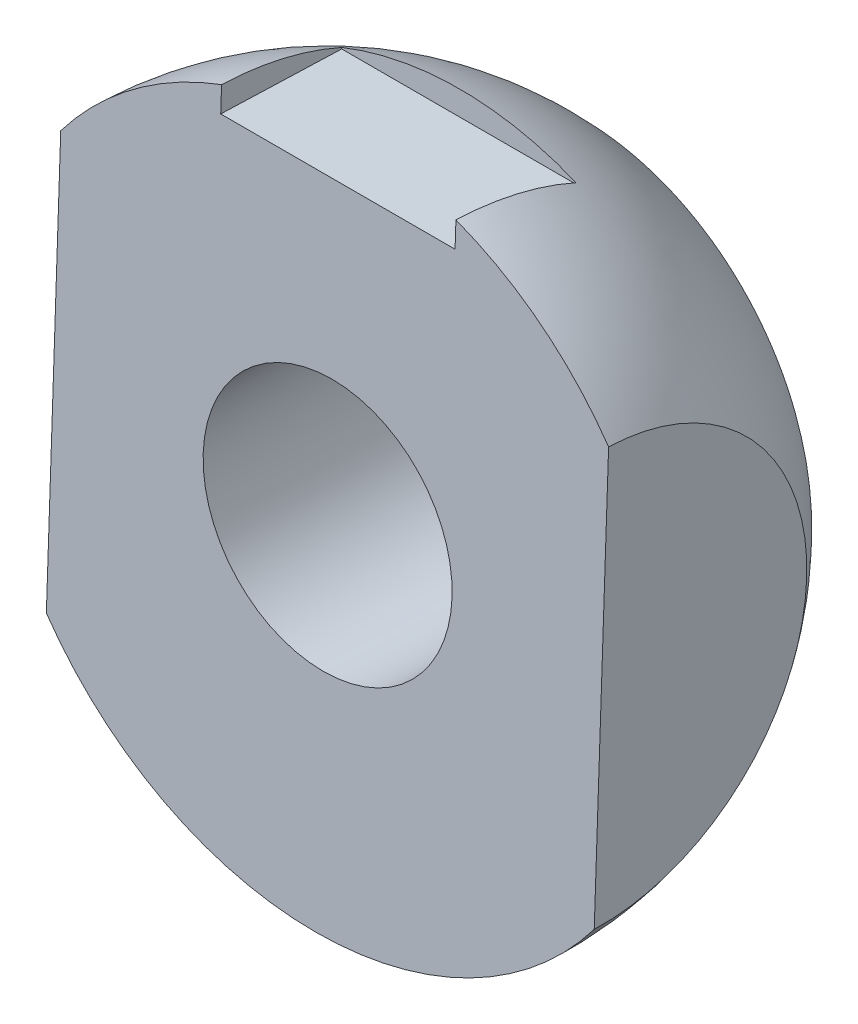
ISO-10303-21;
HEADER;
FILE_DESCRIPTION(('STEP AP214'),'2;1');
FILE_NAME('part.step','',(''),(''),'','','');
FILE_SCHEMA(('AUTOMOTIVE_DESIGN { 1 0 10303 214 1 1 1 1 }'));
ENDSEC;
DATA;
#1=APPLICATION_CONTEXT('core data for automotive mechanical design processes');
#2=APPLICATION_PROTOCOL_DEFINITION('international standard','automotive_design',2000,#1);
#3=PRODUCT_CONTEXT('',#1,'mechanical');
#4=PRODUCT('Part','Part','',(#3));
#5=PRODUCT_RELATED_PRODUCT_CATEGORY('part','',(#4));
#6=PRODUCT_DEFINITION_FORMATION('','',#4);
#7=PRODUCT_DEFINITION_CONTEXT('part definition',#1,'design');
#8=PRODUCT_DEFINITION('design','',#6,#7);
#9=PRODUCT_DEFINITION_SHAPE('','',#8);
#10=(LENGTH_UNIT() NAMED_UNIT(*) SI_UNIT(.MILLI.,.METRE.));
#11=(NAMED_UNIT(*) PLANE_ANGLE_UNIT() SI_UNIT($,.RADIAN.));
#12=(NAMED_UNIT(*) SI_UNIT($,.STERADIAN.) SOLID_ANGLE_UNIT());
#13=UNCERTAINTY_MEASURE_WITH_UNIT(LENGTH_MEASURE(1.E-05),#10,'distance_accuracy_value','');
#14=(GEOMETRIC_REPRESENTATION_CONTEXT(3) GLOBAL_UNCERTAINTY_ASSIGNED_CONTEXT((#13)) GLOBAL_UNIT_ASSIGNED_CONTEXT((#10,
#11,#12)) REPRESENTATION_CONTEXT('',''));
#15=CARTESIAN_POINT('',(0.,0.,0.));
#16=DIRECTION('',(0.,0.,1.));
#17=DIRECTION('',(1.,0.,0.));
#18=AXIS2_PLACEMENT_3D('',#15,#16,#17);
#19=CARTESIAN_POINT('',(0.,-62.5997275361334,0.));
#20=DIRECTION('',(0.,0.,1.));
#21=DIRECTION('',(1.,0.,0.));
#22=AXIS2_PLACEMENT_3D('',#19,#20,#21);
#23=SPHERICAL_SURFACE('',#22,41.666667);
#24=CARTESIAN_POINT('',(-0.00273220957163505,-63.6508301297777,-29.9815806099789));
#25=DIRECTION('',(9.10736523878353E-05,0.0350367531214781,0.999386020332631));
#26=DIRECTION('',(0.,-0.99938602447729,0.0350367532667827));
#27=AXIS2_PLACEMENT_3D('',#24,#25,#26);
#28=CIRCLE('',#27,28.9155864351545);
#29=CARTESIAN_POINT('',(-28.8991878997765,-62.5997275361334,-30.0157971345474));
#30=VERTEX_POINT('',#29);
#31=EDGE_CURVE('E91',#30,#30,#28,.F.);
#32=ORIENTED_EDGE('',*,*,#31,.F.);
#33=CARTESIAN_POINT('',(0.,-62.5997275361334,0.));
#34=DIRECTION('',(0.,-1.,0.));
#35=DIRECTION('',(-1.,0.,0.));
#36=AXIS2_PLACEMENT_3D('',#33,#34,#35);
#37=CIRCLE('',#36,41.666667);
#38=CARTESIAN_POINT('',(-33.3356117017015,-62.5997275361334,-24.9969624427104));
#39=VERTEX_POINT('',#38);
#40=EDGE_CURVE('E12',#39,#30,#37,.T.);
#41=ORIENTED_EDGE('',*,*,#40,.F.);
#42=CARTESIAN_POINT('',(-33.3333334615899,-62.5997275361334,0.00303765348206789));
#43=DIRECTION('',(0.999999995847698,0.,-9.1129603733E-05));
#44=DIRECTION('',(9.10736523873779E-05,0.0350367531214772,0.999386020332631));
#45=AXIS2_PLACEMENT_3D('',#42,#43,#44);
#46=CIRCLE('',#45,25.0000002);
#47=CARTESIAN_POINT('',(-33.3334132837263,-37.6150767241966,-0.872881177925133));
#48=VERTEX_POINT('',#47);
#49=EDGE_CURVE('E85',#39,#48,#46,.T.);
#50=ORIENTED_EDGE('',*,*,#49,.T.);
#51=CARTESIAN_POINT('',(0.,-62.5997275361334,0.));
#52=DIRECTION('',(-9.10736523873779E-05,-0.0350367531214772,-0.999386020332631));
#53=DIRECTION('',(-0.999999995847698,0.,9.1129603733E-05));
#54=AXIS2_PLACEMENT_3D('',#51,#52,#53);
#55=CIRCLE('',#54,41.666667);
#56=CARTESIAN_POINT('',(-14.2587673937659,-23.4727467412801,-1.37042518167016));
#57=VERTEX_POINT('',#56);
#58=EDGE_CURVE('E207',#48,#57,#55,.T.);
#59=ORIENTED_EDGE('',*,*,#58,.T.);
#60=CARTESIAN_POINT('',(-14.2586423890492,-62.5997275361334,0.00129938443608005));
#61=DIRECTION('',(-0.999999995847698,0.,9.1129603733E-05));
#62=DIRECTION('',(-9.10736523873779E-05,-0.0350367531214772,-0.999386020332631));
#63=AXIS2_PLACEMENT_3D('',#60,#61,#62);
#64=CIRCLE('',#63,39.1510185617399);
#65=CARTESIAN_POINT('',(-14.2601002782212,-26.8664512677541,-15.9966760944782));
#66=VERTEX_POINT('',#65);
#67=EDGE_CURVE('E183',#57,#66,#64,.T.);
#68=ORIENTED_EDGE('',*,*,#67,.T.);
#69=CARTESIAN_POINT('',(-0.00134207729779265,-63.1160352686123,-14.7271274892414));
#70=DIRECTION('',(-9.10736523873778E-05,-0.0350367531214772,-0.999386020332631));
#71=DIRECTION('',(0.999999995847698,0.,-9.11296037329377E-05));
#72=AXIS2_PLACEMENT_3D('',#69,#70,#71);
#73=CIRCLE('',#72,38.9737896454621);
#74=CARTESIAN_POINT('',(14.2571844998772,-26.8664512677541,-15.9992748633503));
#75=VERTEX_POINT('',#74);
#76=EDGE_CURVE('E186',#66,#75,#73,.T.);
#77=ORIENTED_EDGE('',*,*,#76,.T.);
#78=CARTESIAN_POINT('',(14.2586423890492,-62.5997275361334,-0.00129938443608005));
#79=DIRECTION('',(0.999999995847698,0.,-9.11296037329999E-05));
#80=DIRECTION('',(9.10736523873778E-05,0.0350367531214799,0.999386020332631));
#81=AXIS2_PLACEMENT_3D('',#78,#79,#80);
#82=CIRCLE('',#81,39.1510185617399);
#83=CARTESIAN_POINT('',(14.2585173843326,-23.4727467412801,-1.37302395054232));
#84=VERTEX_POINT('',#83);
#85=EDGE_CURVE('E156',#75,#84,#82,.T.);
#86=ORIENTED_EDGE('',*,*,#85,.T.);
#87=CARTESIAN_POINT('',(0.,-62.5997275361334,0.));
#88=DIRECTION('',(-9.10736523873779E-05,-0.0350367531214772,-0.999386020332631));
#89=DIRECTION('',(-0.999999995847698,0.,9.1129603733E-05));
#90=AXIS2_PLACEMENT_3D('',#87,#88,#89);
#91=CIRCLE('',#90,41.666667);
#92=CARTESIAN_POINT('',(33.3332536394536,-37.6150767241966,-0.878956484889268));
#93=VERTEX_POINT('',#92);
#94=EDGE_CURVE('E159',#84,#93,#91,.T.);
#95=ORIENTED_EDGE('',*,*,#94,.T.);
#96=CARTESIAN_POINT('',(33.3333334615899,-62.5997275361334,-0.00303765348206789));
#97=DIRECTION('',(-0.999999995847698,0.,9.1129603733E-05));
#98=DIRECTION('',(-9.10736523873779E-05,-0.0350367531214772,-0.999386020332631));
#99=AXIS2_PLACEMENT_3D('',#96,#97,#98);
#100=CIRCLE('',#99,25.0000002);
#101=CARTESIAN_POINT('',(33.3334132837263,-87.5843783480702,0.872881177925136));
#102=VERTEX_POINT('',#101);
#103=EDGE_CURVE('E149',#93,#102,#100,.T.);
#104=ORIENTED_EDGE('',*,*,#103,.T.);
#105=CARTESIAN_POINT('',(0.,-62.5997275361334,0.));
#106=DIRECTION('',(9.10736523873779E-05,0.0350367531214773,0.999386020332631));
#107=DIRECTION('',(-3.19288542805118E-06,0.999386024482384,-0.0350367529759941));
#108=AXIS2_PLACEMENT_3D('',#105,#106,#107);
#109=CIRCLE('',#108,41.666667);
#110=CARTESIAN_POINT('',(-33.3332536394536,-87.5843783480702,0.878956484889271));
#111=VERTEX_POINT('',#110);
#112=EDGE_CURVE('E170',#111,#102,#109,.T.);
#113=ORIENTED_EDGE('',*,*,#112,.F.);
#114=CARTESIAN_POINT('',(-33.3333334615899,-62.5997275361334,0.00303765348206789));
#115=DIRECTION('',(0.999999995847698,0.,-9.1129603733E-05));
#116=DIRECTION('',(9.10736523873779E-05,0.0350367531214772,0.999386020332631));
#117=AXIS2_PLACEMENT_3D('',#114,#115,#116);
#118=CIRCLE('',#117,25.0000002);
#119=EDGE_CURVE('E185',#111,#39,#118,.T.);
#120=ORIENTED_EDGE('',*,*,#119,.T.);
#121=ORIENTED_EDGE('',*,*,#40,.T.);
#122=EDGE_LOOP('',(#32,#41,#50,#59,#68,#77,#86,#95,#104,#113,#120,#121));
#123=FACE_BOUND('',#122,.T.);
#124=ADVANCED_FACE('F75',(#123),#23,.T.);
#125=CARTESIAN_POINT('',(-33.3333334615899,-62.5997275361334,0.00303765348206789));
#126=DIRECTION('',(-0.999999995847698,0.,9.1129603733E-05));
#127=DIRECTION('',(0.,1.,0.));
#128=AXIS2_PLACEMENT_3D('',#125,#126,#127);
#129=PLANE('',#128);
#130=ORIENTED_EDGE('',*,*,#119,.F.);
#131=DIRECTION('',(-3.19288542799705E-06,0.999386024482384,-0.0350367529759949));
#132=VECTOR('',#131,1.);
#133=CARTESIAN_POINT('',(-33.3332536394536,-87.5843783480702,0.878956484889346));
#134=LINE('',#133,#132);
#135=EDGE_CURVE('E175',#111,#48,#134,.T.);
#136=ORIENTED_EDGE('',*,*,#135,.T.);
#137=ORIENTED_EDGE('',*,*,#49,.F.);
#138=EDGE_LOOP('',(#130,#136,#137));
#139=FACE_BOUND('',#138,.T.);
#140=ADVANCED_FACE('F263',(#139),#129,.T.);
#141=CARTESIAN_POINT('',(-14.2574333486454,-20.4423351170931,13.2685621546654));
#142=DIRECTION('',(0.999999995847698,0.,-9.1129603733E-05));
#143=DIRECTION('',(0.,-1.,0.));
#144=AXIS2_PLACEMENT_3D('',#141,#142,#143);
#145=PLANE('',#144);
#146=ORIENTED_EDGE('',*,*,#67,.F.);
#147=DIRECTION('',(3.19288542795622E-06,-0.999386024482384,0.0350367529759949));
#148=VECTOR('',#147,1.);
#149=CARTESIAN_POINT('',(-14.2587673937659,-23.4727467412801,-1.37042518167015));
#150=LINE('',#149,#148);
#151=CARTESIAN_POINT('',(-14.2587576876906,-26.5107874744469,-1.26391670537431));
#152=VERTEX_POINT('',#151);
#153=EDGE_CURVE('E210',#57,#152,#150,.T.);
#154=ORIENTED_EDGE('',*,*,#153,.T.);
#155=DIRECTION('',(9.10736523875079E-05,0.0350367531214772,0.999386020332631));
#156=VECTOR('',#155,1.);
#157=CARTESIAN_POINT('',(-14.2600997649884,-27.0270952069258,-15.9910441946157));
#158=LINE('',#157,#156);
#159=CARTESIAN_POINT('',(-14.2600997649884,-27.0270952069258,-15.9910441946157));
#160=VERTEX_POINT('',#159);
#161=EDGE_CURVE('E165',#160,#152,#158,.T.);
#162=ORIENTED_EDGE('',*,*,#161,.F.);
#163=DIRECTION('',(3.1928854297978E-06,-0.999386024482384,0.0350367529759889));
#164=VECTOR('',#163,1.);
#165=CARTESIAN_POINT('',(-14.2601002782212,-26.8664512677541,-15.9966760944782));
#166=LINE('',#165,#164);
#167=EDGE_CURVE('E194',#66,#160,#166,.T.);
#168=ORIENTED_EDGE('',*,*,#167,.F.);
#169=EDGE_LOOP('',(#146,#154,#162,#168));
#170=FACE_BOUND('',#169,.T.);
#171=ADVANCED_FACE('F228',(#170),#145,.T.);
#172=CARTESIAN_POINT('',(14.2571672748575,-21.4749505820509,-16.1882915926894));
#173=DIRECTION('',(9.10736523873779E-05,0.0350367531214772,0.999386020332631));
#174=DIRECTION('',(0.9999966216425,-0.00259936599696489,0.));
#175=AXIS2_PLACEMENT_3D('',#172,#173,#174);
#176=PLANE('',#175);
#177=ORIENTED_EDGE('',*,*,#167,.T.);
#178=DIRECTION('',(-0.999999995847698,0.,9.11296037329823E-05));
#179=VECTOR('',#178,1.);
#180=CARTESIAN_POINT('',(14.25718501311,-27.0270952069258,-15.9936429634878));
#181=LINE('',#180,#179);
#182=CARTESIAN_POINT('',(14.25718501311,-27.0270952069258,-15.9936429634878));
#183=VERTEX_POINT('',#182);
#184=EDGE_CURVE('E79',#183,#160,#181,.T.);
#185=ORIENTED_EDGE('',*,*,#184,.F.);
#186=DIRECTION('',(3.1928854297978E-06,-0.999386024482384,0.0350367529759889));
#187=VECTOR('',#186,1.);
#188=CARTESIAN_POINT('',(14.2571844998772,-26.8664512677541,-15.9992748633503));
#189=LINE('',#188,#187);
#190=EDGE_CURVE('E199',#75,#183,#189,.T.);
#191=ORIENTED_EDGE('',*,*,#190,.F.);
#192=ORIENTED_EDGE('',*,*,#76,.F.);
#193=EDGE_LOOP('',(#177,#185,#191,#192));
#194=FACE_BOUND('',#193,.T.);
#195=ADVANCED_FACE('F276',(#194),#176,.T.);
#196=CARTESIAN_POINT('',(14.2598514294531,-20.4423351170931,13.2659633857933));
#197=DIRECTION('',(-0.999999995847698,0.,9.1129603733E-05));
#198=DIRECTION('',(0.,1.,0.));
#199=AXIS2_PLACEMENT_3D('',#196,#197,#198);
#200=PLANE('',#199);
#201=DIRECTION('',(-9.10736523873573E-05,-0.0350367531214772,-0.999386020332631));
#202=VECTOR('',#201,1.);
#203=CARTESIAN_POINT('',(14.2585270904078,-26.5107874744469,-1.26651547424648));
#204=LINE('',#203,#202);
#205=CARTESIAN_POINT('',(14.2585270904078,-26.5107874744469,-1.26651547424648));
#206=VERTEX_POINT('',#205);
#207=EDGE_CURVE('E180',#206,#183,#204,.T.);
#208=ORIENTED_EDGE('',*,*,#207,.F.);
#209=DIRECTION('',(-3.19288542795622E-06,0.999386024482384,-0.035036752975995));
#210=VECTOR('',#209,1.);
#211=CARTESIAN_POINT('',(14.2585270904078,-26.5107874744469,-1.26651547424648));
#212=LINE('',#211,#210);
#213=EDGE_CURVE('E231',#206,#84,#212,.T.);
#214=ORIENTED_EDGE('',*,*,#213,.T.);
#215=ORIENTED_EDGE('',*,*,#85,.F.);
#216=ORIENTED_EDGE('',*,*,#190,.T.);
#217=EDGE_LOOP('',(#208,#214,#215,#216));
#218=FACE_BOUND('',#217,.T.);
#219=ADVANCED_FACE('F277',(#218),#200,.T.);
#220=CARTESIAN_POINT('',(33.3333334615899,-62.5997275361334,-0.00303765348206789));
#221=DIRECTION('',(0.999999995847698,0.,-9.1129603733E-05));
#222=DIRECTION('',(0.,-1.,0.));
#223=AXIS2_PLACEMENT_3D('',#220,#221,#222);
#224=PLANE('',#223);
#225=ORIENTED_EDGE('',*,*,#103,.F.);
#226=DIRECTION('',(3.19288542799705E-06,-0.999386024482384,0.0350367529759949));
#227=VECTOR('',#226,1.);
#228=CARTESIAN_POINT('',(33.3332536394536,-37.6150767241966,-0.878956484889265));
#229=LINE('',#228,#227);
#230=EDGE_CURVE('E152',#93,#102,#229,.T.);
#231=ORIENTED_EDGE('',*,*,#230,.T.);
#232=EDGE_LOOP('',(#225,#231));
#233=FACE_BOUND('',#232,.T.);
#234=ADVANCED_FACE('F77',(#233),#224,.T.);
#235=CARTESIAN_POINT('',(-0.000115298641379792,-26.5107874744469,-1.2652160898104));
#236=DIRECTION('',(-3.19288542805117E-06,0.999386024482384,-0.035036752975994));
#237=DIRECTION('',(-0.999999995847698,0.,9.11296037330001E-05));
#238=AXIS2_PLACEMENT_3D('',#235,#236,#237);
#239=PLANE('',#238);
#240=ORIENTED_EDGE('',*,*,#161,.T.);
#241=DIRECTION('',(0.999999995847698,0.,-9.112960373343E-05));
#242=VECTOR('',#241,1.);
#243=CARTESIAN_POINT('',(-14.2587576876906,-26.5107874744469,-1.26391670537431));
#244=LINE('',#243,#242);
#245=EDGE_CURVE('E202',#152,#206,#244,.T.);
#246=ORIENTED_EDGE('',*,*,#245,.T.);
#247=ORIENTED_EDGE('',*,*,#207,.T.);
#248=ORIENTED_EDGE('',*,*,#184,.T.);
#249=EDGE_LOOP('',(#240,#246,#247,#248));
#250=FACE_BOUND('',#249,.T.);
#251=ADVANCED_FACE('F222',(#250),#239,.T.);
#252=CARTESIAN_POINT('',(-0.000199751040257114,-0.0768458022683134,-2.19194456295436));
#253=DIRECTION('',(9.10736523878124E-05,0.0350367531214781,0.999386020332631));
#254=DIRECTION('',(0.9999966216425,-0.00259936599697722,0.));
#255=AXIS2_PLACEMENT_3D('',#252,#253,#254);
#256=PLANE('',#255);
#257=ORIENTED_EDGE('',*,*,#213,.F.);
#258=ORIENTED_EDGE('',*,*,#245,.F.);
#259=ORIENTED_EDGE('',*,*,#153,.F.);
#260=ORIENTED_EDGE('',*,*,#58,.F.);
#261=ORIENTED_EDGE('',*,*,#135,.F.);
#262=ORIENTED_EDGE('',*,*,#112,.T.);
#263=ORIENTED_EDGE('',*,*,#230,.F.);
#264=ORIENTED_EDGE('',*,*,#94,.F.);
#265=EDGE_LOOP('',(#257,#258,#259,#260,#261,#262,#263,#264));
#266=FACE_BOUND('',#265,.T.);
#267=CARTESIAN_POINT('',(-0.000199751040256432,-62.104517379524,-0.0173611972303644));
#268=DIRECTION('',(9.10736523878124E-05,0.0350367531214781,0.999386020332631));
#269=DIRECTION('',(0.,-0.99938602447729,0.0350367532667827));
#270=AXIS2_PLACEMENT_3D('',#267,#268,#269);
#271=CIRCLE('',#270,15.143167570896);
#272=CARTESIAN_POINT('',(-0.000199751040256432,-46.9706473428528,-0.547928623089396));
#273=VERTEX_POINT('',#272);
#274=EDGE_CURVE('E239',#273,#273,#271,.F.);
#275=ORIENTED_EDGE('',*,*,#274,.T.);
#276=EDGE_LOOP('',(#275));
#277=FACE_BOUND('',#276,.T.);
#278=ADVANCED_FACE('F167',(#266,#277),#256,.T.);
#279=CARTESIAN_POINT('',(-0.00293196061189222,-1.12794839591266,-32.1735251729333));
#280=DIRECTION('',(9.10736523878353E-05,0.0350367531214781,0.999386020332631));
#281=DIRECTION('',(0.,-0.99938602447729,0.0350367532667827));
#282=AXIS2_PLACEMENT_3D('',#279,#280,#281);
#283=PLANE('',#282);
#284=ORIENTED_EDGE('',*,*,#31,.T.);
#285=EDGE_LOOP('',(#284));
#286=FACE_BOUND('',#285,.T.);
#287=CARTESIAN_POINT('',(-0.00293196061189149,-63.1556199731683,-29.9989418072093));
#288=DIRECTION('',(-9.10736523878353E-05,-0.0350367531214781,-0.999386020332631));
#289=DIRECTION('',(0.,0.99938602447729,-0.0350367532667827));
#290=AXIS2_PLACEMENT_3D('',#287,#288,#289);
#291=CIRCLE('',#290,15.143167570896);
#292=CARTESIAN_POINT('',(-0.00293196061189149,-48.0217499364971,-30.5295092330683));
#293=VERTEX_POINT('',#292);
#294=EDGE_CURVE('E245',#293,#293,#291,.T.);
#295=ORIENTED_EDGE('',*,*,#294,.F.);
#296=EDGE_LOOP('',(#295));
#297=FACE_BOUND('',#296,.T.);
#298=ADVANCED_FACE('F253',(#286,#297),#283,.F.);
#299=CARTESIAN_POINT('',(0.00434504404055386,-60.3560988297116,49.8544134593551));
#300=DIRECTION('',(-9.10736523878353E-05,-0.0350367531214781,-0.999386020332631));
#301=DIRECTION('',(0.,0.99938602447729,-0.0350367532667827));
#302=AXIS2_PLACEMENT_3D('',#299,#300,#301);
#303=CYLINDRICAL_SURFACE('',#302,15.143167570896);
#304=CARTESIAN_POINT('',(-0.00293196061189149,-48.0217499364971,-30.5295092330683));
#305=CARTESIAN_POINT('',(-0.00290350009552029,-48.0108009511467,-30.2172011017144));
#306=CARTESIAN_POINT('',(-0.00287503957914909,-47.9998519657962,-29.9048929703604));
#307=CARTESIAN_POINT('',(-0.0028181185464067,-47.9779539950953,-29.2802767076525));
#308=CARTESIAN_POINT('',(-0.0027896580300355,-47.9670050097448,-28.9679685762986));
#309=CARTESIAN_POINT('',(-0.0027327369972931,-47.9451070390439,-28.3433523135907));
#310=CARTESIAN_POINT('',(-0.0027042764809219,-47.9341580536934,-28.0310441822368));
#311=CARTESIAN_POINT('',(-0.00264735544817951,-47.9122600829925,-27.4064279195289));
#312=CARTESIAN_POINT('',(-0.00261889493180831,-47.9013110976421,-27.0941197881749));
#313=CARTESIAN_POINT('',(-0.00256197389906591,-47.8794131269411,-26.469503525467));
#314=CARTESIAN_POINT('',(-0.00253351338269471,-47.8684641415907,-26.1571953941131));
#315=CARTESIAN_POINT('',(-0.00247659234995231,-47.8465661708897,-25.5325791314052));
#316=CARTESIAN_POINT('',(-0.00244813183358111,-47.8356171855393,-25.2202710000512));
#317=CARTESIAN_POINT('',(-0.00239121080083872,-47.8137192148384,-24.5956547373433));
#318=CARTESIAN_POINT('',(-0.00236275028446752,-47.8027702294879,-24.2833466059894));
#319=CARTESIAN_POINT('',(-0.00230582925172512,-47.780872258787,-23.6587303432815));
#320=CARTESIAN_POINT('',(-0.00227736873535392,-47.7699232734365,-23.3464222119275));
#321=CARTESIAN_POINT('',(-0.00222044770261153,-47.7480253027356,-22.7218059492196));
#322=CARTESIAN_POINT('',(-0.00219198718624033,-47.7370763173851,-22.4094978178657));
#323=CARTESIAN_POINT('',(-0.00213506615349793,-47.7151783466842,-21.7848815551578));
#324=CARTESIAN_POINT('',(-0.00210660563712673,-47.7042293613337,-21.4725734238039));
#325=CARTESIAN_POINT('',(-0.00204968460438434,-47.6823313906328,-20.847957161096));
#326=CARTESIAN_POINT('',(-0.00202122408801314,-47.6713824052824,-20.535649029742));
#327=CARTESIAN_POINT('',(-0.00196430305527074,-47.6494844345814,-19.9110327670341));
#328=CARTESIAN_POINT('',(-0.00193584253889954,-47.638535449231,-19.5987246356802));
#329=CARTESIAN_POINT('',(-0.00187892150615715,-47.61663747853,-18.9741083729723));
#330=CARTESIAN_POINT('',(-0.00185046098978595,-47.6056884931796,-18.6618002416183));
#331=CARTESIAN_POINT('',(-0.00179353995704355,-47.5837905224787,-18.0371839789104));
#332=CARTESIAN_POINT('',(-0.00176507944067235,-47.5728415371282,-17.7248758475565));
#333=CARTESIAN_POINT('',(-0.00170815840792995,-47.5509435664273,-17.1002595848486));
#334=CARTESIAN_POINT('',(-0.00167969789155876,-47.5399945810768,-16.7879514534946));
#335=CARTESIAN_POINT('',(-0.00162277685881636,-47.5180966103759,-16.1633351907868));
#336=CARTESIAN_POINT('',(-0.00159431634244516,-47.5071476250254,-15.8510270594328));
#337=CARTESIAN_POINT('',(-0.00153739530970276,-47.4852496543245,-15.2264107967249));
#338=CARTESIAN_POINT('',(-0.00150893479333156,-47.474300668974,-14.914102665371));
#339=CARTESIAN_POINT('',(-0.00145201376058917,-47.4524026982731,-14.2894864026631));
#340=CARTESIAN_POINT('',(-0.00142355324421797,-47.4414537129227,-13.9771782713091));
#341=CARTESIAN_POINT('',(-0.00136663221147557,-47.4195557422217,-13.3525620086012));
#342=CARTESIAN_POINT('',(-0.00133817169510437,-47.4086067568713,-13.0402538772473));
#343=CARTESIAN_POINT('',(-0.00128125066236198,-47.3867087861703,-12.4156376145394));
#344=CARTESIAN_POINT('',(-0.00125279014599078,-47.3757598008199,-12.1033294831854));
#345=CARTESIAN_POINT('',(-0.00119586911324838,-47.353861830119,-11.4787132204775));
#346=CARTESIAN_POINT('',(-0.00116740859687718,-47.3429128447685,-11.1664050891236));
#347=CARTESIAN_POINT('',(-0.00111048756413478,-47.3210148740676,-10.5417888264157));
#348=CARTESIAN_POINT('',(-0.00108202704776359,-47.3100658887171,-10.2294806950618));
#349=CARTESIAN_POINT('',(-0.00102510601502119,-47.2881679180162,-9.60486443235387));
#350=CARTESIAN_POINT('',(-0.00099664549864999,-47.2772189326657,-9.29255630099992));
#351=CARTESIAN_POINT('',(-0.000939724465907593,-47.2553209619648,-8.66794003829203));
#352=CARTESIAN_POINT('',(-0.000911263949536395,-47.2443719766143,-8.35563190693808));
#353=CARTESIAN_POINT('',(-0.000854342916793998,-47.2224740059134,-7.73101564423018));
#354=CARTESIAN_POINT('',(-0.000825882400422799,-47.211525020563,-7.41870751287623));
#355=CARTESIAN_POINT('',(-0.000768961367680402,-47.189627049862,-6.79409125016834));
#356=CARTESIAN_POINT('',(-0.000740500851309204,-47.1786780645116,-6.48178311881439));
#357=CARTESIAN_POINT('',(-0.000683579818566807,-47.1567800938107,-5.8571668561065));
#358=CARTESIAN_POINT('',(-0.000655119302195608,-47.1458311084602,-5.54485872475255));
#359=CARTESIAN_POINT('',(-0.000598198269453211,-47.1239331377593,-4.92024246204466));
#360=CARTESIAN_POINT('',(-0.000569737753082013,-47.1129841524088,-4.60793433069071));
#361=CARTESIAN_POINT('',(-0.000512816720339615,-47.0910861817079,-3.98331806798282));
#362=CARTESIAN_POINT('',(-0.000484356203968417,-47.0801371963574,-3.67100993662887));
#363=CARTESIAN_POINT('',(-0.00042743517122602,-47.0582392256565,-3.04639367392097));
#364=CARTESIAN_POINT('',(-0.000398974654854821,-47.047290240306,-2.73408554256702));
#365=CARTESIAN_POINT('',(-0.000342053622112425,-47.0253922696051,-2.10946927985913));
#366=CARTESIAN_POINT('',(-0.000313593105741226,-47.0144432842546,-1.79716114850519));
#367=CARTESIAN_POINT('',(-0.000256672072998829,-46.9925453135537,-1.17254488579729));
#368=CARTESIAN_POINT('',(-0.00022821155662763,-46.9815963282033,-0.860236754443344));
#369=CARTESIAN_POINT('',(-0.000199751040256432,-46.9706473428528,-0.547928623089396));
#370=B_SPLINE_CURVE_WITH_KNOTS('',3,(#304,#305,#306,#307,#308,#309,#310,#311,#312,#313,#314,
#315,#316,#317,#318,#319,#320,#321,#322,#323,#324,#325,#326,#327,#328,#329,#330,#331,#332,#333,
#334,#335,#336,#337,#338,#339,#340,#341,#342,#343,#344,#345,#346,#347,#348,#349,#350,#351,#352,
#353,#354,#355,#356,#357,#358,#359,#360,#361,#362,#363,#364,#365,#366,#367,#368,#369),
.UNSPECIFIED.,.F.,.F.,(4,2,2,2,2,2,2,2,2,2,2,2,2,2,2,2,2,2,2,2,2,2,2,2,2,2,2,2,2,2,2,2,4),(0.,
0.937500000000003,1.87500000000001,2.81249999999999,3.75000000000001,4.6875,5.625,6.5625,
7.50000000000001,8.43750000000001,9.375,10.3125,11.25,12.1875,13.125,14.0625,15.,15.9375,16.875,
17.8125,18.75,19.6875,20.625,21.5625,22.5,23.4375,24.375,25.3125,26.25,27.1875,28.125,29.0625,
30.),.UNSPECIFIED.);
#371=EDGE_CURVE('BSEAM250',#293,#273,#370,.T.);
#372=ORIENTED_EDGE('',*,*,#294,.T.);
#373=ORIENTED_EDGE('',*,*,#274,.F.);
#374=ORIENTED_EDGE('',*,*,#371,.T.);
#375=ORIENTED_EDGE('',*,*,#371,.F.);
#376=EDGE_LOOP('',(#372,#374,#373,#375));
#377=FACE_BOUND('',#376,.T.);
#378=ADVANCED_FACE('F250',(#377),#303,.F.);
#379=CLOSED_SHELL('',(#124,#140,#171,#195,#219,#234,#251,#278,#298,#378));
#380=MANIFOLD_SOLID_BREP('B2',#379);
#381=ADVANCED_BREP_SHAPE_REPRESENTATION('',(#18,#380),#14);
#382=SHAPE_DEFINITION_REPRESENTATION(#9,#381);
ENDSEC;
END-ISO-10303-21;
